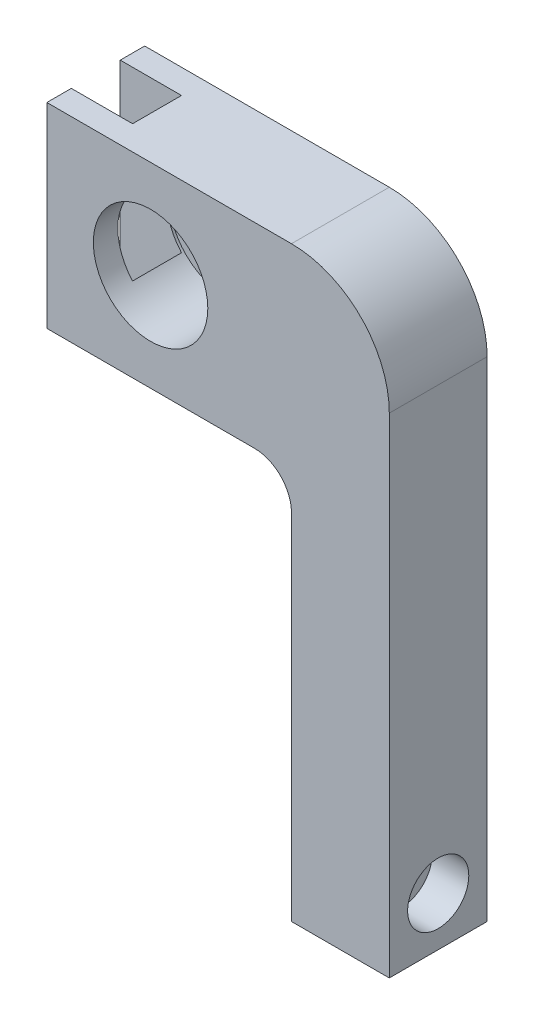
ISO-10303-21;
HEADER;
FILE_DESCRIPTION(('STEP AP214'),'2;1');
FILE_NAME('part.step','',(''),(''),'','','');
FILE_SCHEMA(('AUTOMOTIVE_DESIGN { 1 0 10303 214 1 1 1 1 }'));
ENDSEC;
DATA;
#1=APPLICATION_CONTEXT('core data for automotive mechanical design processes');
#2=APPLICATION_PROTOCOL_DEFINITION('international standard','automotive_design',2000,#1);
#3=PRODUCT_CONTEXT('',#1,'mechanical');
#4=PRODUCT('Part','Part','',(#3));
#5=PRODUCT_RELATED_PRODUCT_CATEGORY('part','',(#4));
#6=PRODUCT_DEFINITION_FORMATION('','',#4);
#7=PRODUCT_DEFINITION_CONTEXT('part definition',#1,'design');
#8=PRODUCT_DEFINITION('design','',#6,#7);
#9=PRODUCT_DEFINITION_SHAPE('','',#8);
#10=(LENGTH_UNIT() NAMED_UNIT(*) SI_UNIT(.MILLI.,.METRE.));
#11=(NAMED_UNIT(*) PLANE_ANGLE_UNIT() SI_UNIT($,.RADIAN.));
#12=(NAMED_UNIT(*) SI_UNIT($,.STERADIAN.) SOLID_ANGLE_UNIT());
#13=UNCERTAINTY_MEASURE_WITH_UNIT(LENGTH_MEASURE(1.E-05),#10,'distance_accuracy_value','');
#14=(GEOMETRIC_REPRESENTATION_CONTEXT(3) GLOBAL_UNCERTAINTY_ASSIGNED_CONTEXT((#13)) GLOBAL_UNIT_ASSIGNED_CONTEXT((#10,
#11,#12)) REPRESENTATION_CONTEXT('',''));
#15=CARTESIAN_POINT('',(0.,0.,0.));
#16=DIRECTION('',(0.,0.,1.));
#17=DIRECTION('',(1.,0.,0.));
#18=AXIS2_PLACEMENT_3D('',#15,#16,#17);
#19=CARTESIAN_POINT('',(-72.9996000000001,0.,-6.35));
#20=DIRECTION('',(1.,0.,0.));
#21=DIRECTION('',(0.,1.,0.));
#22=AXIS2_PLACEMENT_3D('',#19,#20,#21);
#23=PLANE('',#22);
#24=DIRECTION('',(0.,1.,0.));
#25=VECTOR('',#24,1.);
#26=CARTESIAN_POINT('',(-72.9996000000001,0.,-6.35));
#27=LINE('',#26,#25);
#28=CARTESIAN_POINT('',(-72.9996,136.963439368009,-6.35000000000001));
#29=VERTEX_POINT('',#28);
#30=CARTESIAN_POINT('',(-72.9996,152.4,-6.35));
#31=VERTEX_POINT('',#30);
#32=EDGE_CURVE('E237',#29,#31,#27,.T.);
#33=ORIENTED_EDGE('',*,*,#32,.F.);
#34=DIRECTION('',(0.,0.,1.));
#35=VECTOR('',#34,1.);
#36=CARTESIAN_POINT('',(-72.9996,136.963439368009,12.7));
#37=LINE('',#36,#35);
#38=CARTESIAN_POINT('',(-72.9996,136.963439368009,6.34999999999999));
#39=VERTEX_POINT('',#38);
#40=EDGE_CURVE('E70',#29,#39,#37,.T.);
#41=ORIENTED_EDGE('',*,*,#40,.T.);
#42=DIRECTION('',(0.,1.,0.));
#43=VECTOR('',#42,1.);
#44=CARTESIAN_POINT('',(-72.9996000000001,0.,6.34999999999999));
#45=LINE('',#44,#43);
#46=CARTESIAN_POINT('',(-72.9996,152.4,6.34999999999999));
#47=VERTEX_POINT('',#46);
#48=EDGE_CURVE('E239',#39,#47,#45,.T.);
#49=ORIENTED_EDGE('',*,*,#48,.T.);
#50=DIRECTION('',(0.,0.,1.));
#51=VECTOR('',#50,1.);
#52=CARTESIAN_POINT('',(-72.9996,152.4,12.7));
#53=LINE('',#52,#51);
#54=EDGE_CURVE('E243',#31,#47,#53,.T.);
#55=ORIENTED_EDGE('',*,*,#54,.F.);
#56=EDGE_LOOP('',(#33,#41,#49,#55));
#57=FACE_BOUND('',#56,.T.);
#58=ADVANCED_FACE('F54',(#57),#23,.F.);
#59=CARTESIAN_POINT('',(-88.9,152.4,12.7));
#60=DIRECTION('',(1.,0.,0.));
#61=DIRECTION('',(0.,0.,-1.));
#62=AXIS2_PLACEMENT_3D('',#59,#60,#61);
#63=PLANE('',#62);
#64=CARTESIAN_POINT('',(-88.9,149.225,-9.525));
#65=DIRECTION('',(-1.,0.,0.));
#66=DIRECTION('',(0.,0.,1.));
#67=AXIS2_PLACEMENT_3D('',#64,#65,#66);
#68=CIRCLE('',#67,1.72719999999998);
#69=CARTESIAN_POINT('',(-88.9,149.225,-7.79780000000001));
#70=VERTEX_POINT('',#69);
#71=EDGE_CURVE('E176',#70,#70,#68,.T.);
#72=ORIENTED_EDGE('',*,*,#71,.F.);
#73=EDGE_LOOP('',(#72));
#74=FACE_BOUND('',#73,.T.);
#75=CARTESIAN_POINT('',(-88.9,104.775,-9.525));
#76=DIRECTION('',(-1.,0.,0.));
#77=DIRECTION('',(0.,0.,1.));
#78=AXIS2_PLACEMENT_3D('',#75,#76,#77);
#79=CIRCLE('',#78,1.72719999999998);
#80=CARTESIAN_POINT('',(-88.9,104.775,-7.79780000000001));
#81=VERTEX_POINT('',#80);
#82=EDGE_CURVE('E193',#81,#81,#79,.T.);
#83=ORIENTED_EDGE('',*,*,#82,.F.);
#84=EDGE_LOOP('',(#83));
#85=FACE_BOUND('',#84,.T.);
#86=DIRECTION('',(0.,0.,-1.));
#87=VECTOR('',#86,1.);
#88=CARTESIAN_POINT('',(-88.9,101.6,12.7));
#89=LINE('',#88,#87);
#90=CARTESIAN_POINT('',(-88.9,101.6,-6.35));
#91=VERTEX_POINT('',#90);
#92=CARTESIAN_POINT('',(-88.9,101.6,-12.7));
#93=VERTEX_POINT('',#92);
#94=EDGE_CURVE('E294',#91,#93,#89,.T.);
#95=ORIENTED_EDGE('',*,*,#94,.F.);
#96=DIRECTION('',(0.,1.,0.));
#97=VECTOR('',#96,1.);
#98=CARTESIAN_POINT('',(-88.9000000000001,0.,-6.35));
#99=LINE('',#98,#97);
#100=CARTESIAN_POINT('',(-88.9,152.4,-6.35));
#101=VERTEX_POINT('',#100);
#102=EDGE_CURVE('E230',#91,#101,#99,.T.);
#103=ORIENTED_EDGE('',*,*,#102,.T.);
#104=DIRECTION('',(0.,0.,-1.));
#105=VECTOR('',#104,1.);
#106=CARTESIAN_POINT('',(-88.9,152.4,12.7));
#107=LINE('',#106,#105);
#108=CARTESIAN_POINT('',(-88.9,152.4,-12.7));
#109=VERTEX_POINT('',#108);
#110=EDGE_CURVE('E298',#101,#109,#107,.T.);
#111=ORIENTED_EDGE('',*,*,#110,.T.);
#112=DIRECTION('',(0.,-1.,0.));
#113=VECTOR('',#112,1.);
#114=CARTESIAN_POINT('',(-88.9,152.4,-12.7));
#115=LINE('',#114,#113);
#116=EDGE_CURVE('E278',#109,#93,#115,.T.);
#117=ORIENTED_EDGE('',*,*,#116,.T.);
#118=EDGE_LOOP('',(#95,#103,#111,#117));
#119=FACE_BOUND('',#118,.T.);
#120=ADVANCED_FACE('F324',(#74,#85,#119),#63,.F.);
#121=CARTESIAN_POINT('',(-25.4,0.,12.7));
#122=DIRECTION('',(0.,1.,0.));
#123=DIRECTION('',(0.,0.,1.));
#124=AXIS2_PLACEMENT_3D('',#121,#122,#123);
#125=PLANE('',#124);
#126=DIRECTION('',(1.,0.,0.));
#127=VECTOR('',#126,1.);
#128=CARTESIAN_POINT('',(-25.4,0.,-12.7));
#129=LINE('',#128,#127);
#130=CARTESIAN_POINT('',(-25.4,0.,-12.7));
#131=VERTEX_POINT('',#130);
#132=CARTESIAN_POINT('',(0.,0.,-12.7));
#133=VERTEX_POINT('',#132);
#134=EDGE_CURVE('E249',#131,#133,#129,.T.);
#135=ORIENTED_EDGE('',*,*,#134,.T.);
#136=DIRECTION('',(0.,0.,-1.));
#137=VECTOR('',#136,1.);
#138=CARTESIAN_POINT('',(0.,0.,12.7));
#139=LINE('',#138,#137);
#140=CARTESIAN_POINT('',(0.,0.,12.7));
#141=VERTEX_POINT('',#140);
#142=EDGE_CURVE('E308',#141,#133,#139,.T.);
#143=ORIENTED_EDGE('',*,*,#142,.F.);
#144=DIRECTION('',(1.,0.,0.));
#145=VECTOR('',#144,1.);
#146=CARTESIAN_POINT('',(-25.4,0.,12.7));
#147=LINE('',#146,#145);
#148=CARTESIAN_POINT('',(-25.4,0.,12.7));
#149=VERTEX_POINT('',#148);
#150=EDGE_CURVE('E250',#149,#141,#147,.T.);
#151=ORIENTED_EDGE('',*,*,#150,.F.);
#152=DIRECTION('',(0.,0.,-1.));
#153=VECTOR('',#152,1.);
#154=CARTESIAN_POINT('',(-25.4,0.,12.7));
#155=LINE('',#154,#153);
#156=EDGE_CURVE('E268',#149,#131,#155,.T.);
#157=ORIENTED_EDGE('',*,*,#156,.T.);
#158=EDGE_LOOP('',(#135,#143,#151,#157));
#159=FACE_BOUND('',#158,.T.);
#160=ADVANCED_FACE('F56',(#159),#125,.F.);
#161=CARTESIAN_POINT('',(0.,0.,12.7));
#162=DIRECTION('',(-1.,0.,0.));
#163=DIRECTION('',(0.,0.,1.));
#164=AXIS2_PLACEMENT_3D('',#161,#162,#163);
#165=PLANE('',#164);
#166=CARTESIAN_POINT('',(0.,12.7,0.));
#167=DIRECTION('',(1.,0.,0.));
#168=DIRECTION('',(0.,0.,-1.));
#169=AXIS2_PLACEMENT_3D('',#166,#167,#168);
#170=CIRCLE('',#169,7.9375);
#171=CARTESIAN_POINT('',(0.,12.7,-7.9375));
#172=VERTEX_POINT('',#171);
#173=EDGE_CURVE('E199',#172,#172,#170,.T.);
#174=ORIENTED_EDGE('',*,*,#173,.F.);
#175=EDGE_LOOP('',(#174));
#176=FACE_BOUND('',#175,.T.);
#177=DIRECTION('',(0.,1.,0.));
#178=VECTOR('',#177,1.);
#179=CARTESIAN_POINT('',(0.,0.,-12.7));
#180=LINE('',#179,#178);
#181=CARTESIAN_POINT('',(0.,127.,-12.7));
#182=VERTEX_POINT('',#181);
#183=EDGE_CURVE('E271',#133,#182,#180,.T.);
#184=ORIENTED_EDGE('',*,*,#183,.T.);
#185=DIRECTION('',(0.,0.,-1.));
#186=VECTOR('',#185,1.);
#187=CARTESIAN_POINT('',(0.,127.,12.7));
#188=LINE('',#187,#186);
#189=CARTESIAN_POINT('',(0.,127.,12.7));
#190=VERTEX_POINT('',#189);
#191=EDGE_CURVE('E305',#190,#182,#188,.T.);
#192=ORIENTED_EDGE('',*,*,#191,.F.);
#193=DIRECTION('',(0.,1.,0.));
#194=VECTOR('',#193,1.);
#195=CARTESIAN_POINT('',(0.,0.,12.7));
#196=LINE('',#195,#194);
#197=EDGE_CURVE('E253',#141,#190,#196,.T.);
#198=ORIENTED_EDGE('',*,*,#197,.F.);
#199=ORIENTED_EDGE('',*,*,#142,.T.);
#200=EDGE_LOOP('',(#184,#192,#198,#199));
#201=FACE_BOUND('',#200,.T.);
#202=ADVANCED_FACE('F465',(#176,#201),#165,.F.);
#203=CARTESIAN_POINT('',(-25.4,127.,12.7));
#204=DIRECTION('',(0.,0.,-1.));
#205=DIRECTION('',(-1.,0.,0.));
#206=AXIS2_PLACEMENT_3D('',#203,#204,#205);
#207=CYLINDRICAL_SURFACE('',#206,25.4);
#208=CARTESIAN_POINT('',(-25.4,127.,-12.7));
#209=DIRECTION('',(0.,0.,1.));
#210=DIRECTION('',(-1.,0.,0.));
#211=AXIS2_PLACEMENT_3D('',#208,#209,#210);
#212=CIRCLE('',#211,25.4);
#213=CARTESIAN_POINT('',(-25.4,152.4,-12.7));
#214=VERTEX_POINT('',#213);
#215=EDGE_CURVE('E273',#182,#214,#212,.T.);
#216=ORIENTED_EDGE('',*,*,#215,.T.);
#217=DIRECTION('',(0.,0.,-1.));
#218=VECTOR('',#217,1.);
#219=CARTESIAN_POINT('',(-25.4,152.4,12.7));
#220=LINE('',#219,#218);
#221=CARTESIAN_POINT('',(-25.4,152.4,12.7));
#222=VERTEX_POINT('',#221);
#223=EDGE_CURVE('E302',#222,#214,#220,.T.);
#224=ORIENTED_EDGE('',*,*,#223,.F.);
#225=CARTESIAN_POINT('',(-25.4,127.,12.7));
#226=DIRECTION('',(0.,0.,1.));
#227=DIRECTION('',(-1.,0.,0.));
#228=AXIS2_PLACEMENT_3D('',#225,#226,#227);
#229=CIRCLE('',#228,25.4);
#230=EDGE_CURVE('E256',#190,#222,#229,.T.);
#231=ORIENTED_EDGE('',*,*,#230,.F.);
#232=ORIENTED_EDGE('',*,*,#191,.T.);
#233=EDGE_LOOP('',(#216,#224,#231,#232));
#234=FACE_BOUND('',#233,.T.);
#235=ADVANCED_FACE('F460',(#234),#207,.T.);
#236=CARTESIAN_POINT('',(-25.4,152.4,12.7));
#237=DIRECTION('',(0.,-1.,0.));
#238=DIRECTION('',(1.,0.,0.));
#239=AXIS2_PLACEMENT_3D('',#236,#237,#238);
#240=PLANE('',#239);
#241=ORIENTED_EDGE('',*,*,#110,.F.);
#242=DIRECTION('',(1.,0.,0.));
#243=VECTOR('',#242,1.);
#244=CARTESIAN_POINT('',(-25.4,152.4,-6.35000000000001));
#245=LINE('',#244,#243);
#246=EDGE_CURVE('E246',#101,#31,#245,.T.);
#247=ORIENTED_EDGE('',*,*,#246,.T.);
#248=ORIENTED_EDGE('',*,*,#54,.T.);
#249=DIRECTION('',(-1.,0.,0.));
#250=VECTOR('',#249,1.);
#251=CARTESIAN_POINT('',(-25.4,152.4,6.34999999999999));
#252=LINE('',#251,#250);
#253=CARTESIAN_POINT('',(-88.9,152.4,6.35));
#254=VERTEX_POINT('',#253);
#255=EDGE_CURVE('E233',#47,#254,#252,.T.);
#256=ORIENTED_EDGE('',*,*,#255,.T.);
#257=CARTESIAN_POINT('',(-88.9,152.4,12.7));
#258=VERTEX_POINT('',#257);
#259=EDGE_CURVE('E299',#258,#254,#107,.T.);
#260=ORIENTED_EDGE('',*,*,#259,.F.);
#261=DIRECTION('',(-1.,0.,0.));
#262=VECTOR('',#261,1.);
#263=CARTESIAN_POINT('',(-25.4,152.4,12.7));
#264=LINE('',#263,#262);
#265=EDGE_CURVE('E258',#222,#258,#264,.T.);
#266=ORIENTED_EDGE('',*,*,#265,.F.);
#267=ORIENTED_EDGE('',*,*,#223,.T.);
#268=DIRECTION('',(-1.,0.,0.));
#269=VECTOR('',#268,1.);
#270=CARTESIAN_POINT('',(-25.4,152.4,-12.7));
#271=LINE('',#270,#269);
#272=EDGE_CURVE('E275',#214,#109,#271,.T.);
#273=ORIENTED_EDGE('',*,*,#272,.T.);
#274=EDGE_LOOP('',(#241,#247,#248,#256,#260,#266,#267,#273));
#275=FACE_BOUND('',#274,.T.);
#276=ADVANCED_FACE('F354',(#275),#240,.F.);
#277=CARTESIAN_POINT('',(-88.8999999999999,149.225,9.525));
#278=DIRECTION('',(-1.,0.,0.));
#279=DIRECTION('',(0.,0.,1.));
#280=AXIS2_PLACEMENT_3D('',#277,#278,#279);
#281=CIRCLE('',#280,1.72719999999998);
#282=CARTESIAN_POINT('',(-88.8999999999999,149.225,11.2522));
#283=VERTEX_POINT('',#282);
#284=EDGE_CURVE('E177',#283,#283,#281,.T.);
#285=ORIENTED_EDGE('',*,*,#284,.F.);
#286=EDGE_LOOP('',(#285));
#287=FACE_BOUND('',#286,.T.);
#288=CARTESIAN_POINT('',(-88.8999999999999,104.775,9.525));
#289=DIRECTION('',(-1.,0.,0.));
#290=DIRECTION('',(0.,0.,1.));
#291=AXIS2_PLACEMENT_3D('',#288,#289,#290);
#292=CIRCLE('',#291,1.72719999999998);
#293=CARTESIAN_POINT('',(-88.8999999999999,104.775,11.2522));
#294=VERTEX_POINT('',#293);
#295=EDGE_CURVE('E187',#294,#294,#292,.T.);
#296=ORIENTED_EDGE('',*,*,#295,.F.);
#297=EDGE_LOOP('',(#296));
#298=FACE_BOUND('',#297,.T.);
#299=ORIENTED_EDGE('',*,*,#259,.T.);
#300=DIRECTION('',(0.,1.,0.));
#301=VECTOR('',#300,1.);
#302=CARTESIAN_POINT('',(-88.9000000000001,0.,6.35));
#303=LINE('',#302,#301);
#304=CARTESIAN_POINT('',(-88.9,101.6,6.35));
#305=VERTEX_POINT('',#304);
#306=EDGE_CURVE('E229',#305,#254,#303,.T.);
#307=ORIENTED_EDGE('',*,*,#306,.F.);
#308=CARTESIAN_POINT('',(-88.9,101.6,12.7));
#309=VERTEX_POINT('',#308);
#310=EDGE_CURVE('E295',#309,#305,#89,.T.);
#311=ORIENTED_EDGE('',*,*,#310,.F.);
#312=DIRECTION('',(0.,-1.,0.));
#313=VECTOR('',#312,1.);
#314=CARTESIAN_POINT('',(-88.9,152.4,12.7));
#315=LINE('',#314,#313);
#316=EDGE_CURVE('E260',#258,#309,#315,.T.);
#317=ORIENTED_EDGE('',*,*,#316,.F.);
#318=EDGE_LOOP('',(#299,#307,#311,#317));
#319=FACE_BOUND('',#318,.T.);
#320=ADVANCED_FACE('F348',(#287,#298,#319),#63,.F.);
#321=CARTESIAN_POINT('',(-88.9,101.6,12.7));
#322=DIRECTION('',(0.,1.,0.));
#323=DIRECTION('',(-1.,0.,0.));
#324=AXIS2_PLACEMENT_3D('',#321,#322,#323);
#325=PLANE('',#324);
#326=DIRECTION('',(0.,0.,-1.));
#327=VECTOR('',#326,1.);
#328=CARTESIAN_POINT('',(-72.9996,101.6,12.7));
#329=LINE('',#328,#327);
#330=CARTESIAN_POINT('',(-72.9996,101.6,6.34999999999999));
#331=VERTEX_POINT('',#330);
#332=CARTESIAN_POINT('',(-72.9996,101.6,-6.35));
#333=VERTEX_POINT('',#332);
#334=EDGE_CURVE('E314',#331,#333,#329,.T.);
#335=ORIENTED_EDGE('',*,*,#334,.T.);
#336=DIRECTION('',(-1.,0.,0.));
#337=VECTOR('',#336,1.);
#338=CARTESIAN_POINT('',(-88.9,101.6,-6.35));
#339=LINE('',#338,#337);
#340=EDGE_CURVE('E63',#333,#91,#339,.T.);
#341=ORIENTED_EDGE('',*,*,#340,.T.);
#342=ORIENTED_EDGE('',*,*,#94,.T.);
#343=DIRECTION('',(1.,0.,0.));
#344=VECTOR('',#343,1.);
#345=CARTESIAN_POINT('',(-88.9,101.6,-12.7));
#346=LINE('',#345,#344);
#347=CARTESIAN_POINT('',(-35.052,101.6,-12.7));
#348=VERTEX_POINT('',#347);
#349=EDGE_CURVE('E281',#93,#348,#346,.T.);
#350=ORIENTED_EDGE('',*,*,#349,.T.);
#351=DIRECTION('',(0.,0.,-1.));
#352=VECTOR('',#351,1.);
#353=CARTESIAN_POINT('',(-35.052,101.6,12.7));
#354=LINE('',#353,#352);
#355=CARTESIAN_POINT('',(-35.052,101.6,12.7));
#356=VERTEX_POINT('',#355);
#357=EDGE_CURVE('E291',#356,#348,#354,.T.);
#358=ORIENTED_EDGE('',*,*,#357,.F.);
#359=DIRECTION('',(1.,0.,0.));
#360=VECTOR('',#359,1.);
#361=CARTESIAN_POINT('',(-88.9,101.6,12.7));
#362=LINE('',#361,#360);
#363=EDGE_CURVE('E262',#309,#356,#362,.T.);
#364=ORIENTED_EDGE('',*,*,#363,.F.);
#365=ORIENTED_EDGE('',*,*,#310,.T.);
#366=DIRECTION('',(1.,0.,0.));
#367=VECTOR('',#366,1.);
#368=CARTESIAN_POINT('',(-88.9,101.6,6.35));
#369=LINE('',#368,#367);
#370=EDGE_CURVE('E311',#305,#331,#369,.T.);
#371=ORIENTED_EDGE('',*,*,#370,.T.);
#372=EDGE_LOOP('',(#335,#341,#342,#350,#358,#364,#365,#371));
#373=FACE_BOUND('',#372,.T.);
#374=ADVANCED_FACE('F320',(#373),#325,.F.);
#375=CARTESIAN_POINT('',(-35.052,91.948,12.7));
#376=DIRECTION('',(0.,0.,-1.));
#377=DIRECTION('',(-1.,0.,0.));
#378=AXIS2_PLACEMENT_3D('',#375,#376,#377);
#379=CYLINDRICAL_SURFACE('',#378,9.65199999999998);
#380=CARTESIAN_POINT('',(-35.052,91.948,-12.7));
#381=DIRECTION('',(0.,0.,-1.));
#382=DIRECTION('',(-1.,0.,0.));
#383=AXIS2_PLACEMENT_3D('',#380,#381,#382);
#384=CIRCLE('',#383,9.65199999999998);
#385=CARTESIAN_POINT('',(-25.4,91.948,-12.7));
#386=VERTEX_POINT('',#385);
#387=EDGE_CURVE('E283',#348,#386,#384,.T.);
#388=ORIENTED_EDGE('',*,*,#387,.T.);
#389=DIRECTION('',(0.,0.,-1.));
#390=VECTOR('',#389,1.);
#391=CARTESIAN_POINT('',(-25.4,91.948,12.7));
#392=LINE('',#391,#390);
#393=CARTESIAN_POINT('',(-25.4,91.948,12.7));
#394=VERTEX_POINT('',#393);
#395=EDGE_CURVE('E288',#394,#386,#392,.T.);
#396=ORIENTED_EDGE('',*,*,#395,.F.);
#397=CARTESIAN_POINT('',(-35.052,91.948,12.7));
#398=DIRECTION('',(0.,0.,-1.));
#399=DIRECTION('',(-1.,0.,0.));
#400=AXIS2_PLACEMENT_3D('',#397,#398,#399);
#401=CIRCLE('',#400,9.65199999999998);
#402=EDGE_CURVE('E264',#356,#394,#401,.T.);
#403=ORIENTED_EDGE('',*,*,#402,.F.);
#404=ORIENTED_EDGE('',*,*,#357,.T.);
#405=EDGE_LOOP('',(#388,#396,#403,#404));
#406=FACE_BOUND('',#405,.T.);
#407=ADVANCED_FACE('F338',(#406),#379,.F.);
#408=CARTESIAN_POINT('',(-25.4,91.948,12.7));
#409=DIRECTION('',(1.,0.,0.));
#410=DIRECTION('',(0.,1.,0.));
#411=AXIS2_PLACEMENT_3D('',#408,#409,#410);
#412=PLANE('',#411);
#413=CARTESIAN_POINT('',(-25.4,12.7,0.));
#414=DIRECTION('',(1.,0.,0.));
#415=DIRECTION('',(0.,1.,0.));
#416=AXIS2_PLACEMENT_3D('',#413,#414,#415);
#417=CIRCLE('',#416,5.04189999999999);
#418=CARTESIAN_POINT('',(-25.4,17.7419,0.));
#419=VERTEX_POINT('',#418);
#420=EDGE_CURVE('E58',#419,#419,#417,.T.);
#421=ORIENTED_EDGE('',*,*,#420,.T.);
#422=EDGE_LOOP('',(#421));
#423=FACE_BOUND('',#422,.T.);
#424=DIRECTION('',(0.,-1.,0.));
#425=VECTOR('',#424,1.);
#426=CARTESIAN_POINT('',(-25.4,91.948,-12.7));
#427=LINE('',#426,#425);
#428=EDGE_CURVE('E254',#386,#131,#427,.T.);
#429=ORIENTED_EDGE('',*,*,#428,.T.);
#430=ORIENTED_EDGE('',*,*,#156,.F.);
#431=DIRECTION('',(0.,-1.,0.));
#432=VECTOR('',#431,1.);
#433=CARTESIAN_POINT('',(-25.4,91.948,12.7));
#434=LINE('',#433,#432);
#435=EDGE_CURVE('E266',#394,#149,#434,.T.);
#436=ORIENTED_EDGE('',*,*,#435,.F.);
#437=ORIENTED_EDGE('',*,*,#395,.T.);
#438=EDGE_LOOP('',(#429,#430,#436,#437));
#439=FACE_BOUND('',#438,.T.);
#440=ADVANCED_FACE('F482',(#423,#439),#412,.F.);
#441=CARTESIAN_POINT('',(-25.4,127.,12.7));
#442=DIRECTION('',(0.,0.,-1.));
#443=DIRECTION('',(-1.,0.,0.));
#444=AXIS2_PLACEMENT_3D('',#441,#442,#443);
#445=PLANE('',#444);
#446=CARTESIAN_POINT('',(-61.976,127.,12.7));
#447=DIRECTION('',(0.,0.,1.));
#448=DIRECTION('',(1.,0.,0.));
#449=AXIS2_PLACEMENT_3D('',#446,#447,#448);
#450=CIRCLE('',#449,14.859);
#451=CARTESIAN_POINT('',(-47.117,127.,12.7));
#452=VERTEX_POINT('',#451);
#453=EDGE_CURVE('E211',#452,#452,#450,.T.);
#454=ORIENTED_EDGE('',*,*,#453,.F.);
#455=EDGE_LOOP('',(#454));
#456=FACE_BOUND('',#455,.T.);
#457=ORIENTED_EDGE('',*,*,#150,.T.);
#458=ORIENTED_EDGE('',*,*,#197,.T.);
#459=ORIENTED_EDGE('',*,*,#230,.T.);
#460=ORIENTED_EDGE('',*,*,#265,.T.);
#461=ORIENTED_EDGE('',*,*,#316,.T.);
#462=ORIENTED_EDGE('',*,*,#363,.T.);
#463=ORIENTED_EDGE('',*,*,#402,.T.);
#464=ORIENTED_EDGE('',*,*,#435,.T.);
#465=EDGE_LOOP('',(#457,#458,#459,#460,#461,#462,#463,#464));
#466=FACE_BOUND('',#465,.T.);
#467=ADVANCED_FACE('F342',(#456,#466),#445,.F.);
#468=CARTESIAN_POINT('',(-25.4,127.,-12.7));
#469=DIRECTION('',(0.,0.,-1.));
#470=DIRECTION('',(-1.,0.,0.));
#471=AXIS2_PLACEMENT_3D('',#468,#469,#470);
#472=PLANE('',#471);
#473=CARTESIAN_POINT('',(-61.976,127.,-12.7));
#474=DIRECTION('',(0.,0.,1.));
#475=DIRECTION('',(1.,0.,0.));
#476=AXIS2_PLACEMENT_3D('',#473,#474,#475);
#477=CIRCLE('',#476,6.34999999999999);
#478=CARTESIAN_POINT('',(-55.626,127.,-12.7));
#479=VERTEX_POINT('',#478);
#480=EDGE_CURVE('E220',#479,#479,#477,.T.);
#481=ORIENTED_EDGE('',*,*,#480,.T.);
#482=EDGE_LOOP('',(#481));
#483=FACE_BOUND('',#482,.T.);
#484=ORIENTED_EDGE('',*,*,#134,.F.);
#485=ORIENTED_EDGE('',*,*,#428,.F.);
#486=ORIENTED_EDGE('',*,*,#387,.F.);
#487=ORIENTED_EDGE('',*,*,#349,.F.);
#488=ORIENTED_EDGE('',*,*,#116,.F.);
#489=ORIENTED_EDGE('',*,*,#272,.F.);
#490=ORIENTED_EDGE('',*,*,#215,.F.);
#491=ORIENTED_EDGE('',*,*,#183,.F.);
#492=EDGE_LOOP('',(#484,#485,#486,#487,#488,#489,#490,#491));
#493=FACE_BOUND('',#492,.T.);
#494=ADVANCED_FACE('F332',(#483,#493),#472,.T.);
#495=CARTESIAN_POINT('',(-72.9996000000001,0.,-6.35));
#496=DIRECTION('',(0.,0.,-1.));
#497=DIRECTION('',(-1.,0.,0.));
#498=AXIS2_PLACEMENT_3D('',#495,#496,#497);
#499=PLANE('',#498);
#500=CARTESIAN_POINT('',(-72.9996,117.036560631991,-6.35000000000001));
#501=VERTEX_POINT('',#500);
#502=EDGE_CURVE('E234',#333,#501,#27,.T.);
#503=ORIENTED_EDGE('',*,*,#502,.T.);
#504=CARTESIAN_POINT('',(-61.976,127.,-6.35000000000001));
#505=DIRECTION('',(0.,0.,-1.));
#506=DIRECTION('',(-1.,0.,0.));
#507=AXIS2_PLACEMENT_3D('',#504,#505,#506);
#508=CIRCLE('',#507,14.859);
#509=EDGE_CURVE('E13',#501,#29,#508,.T.);
#510=ORIENTED_EDGE('',*,*,#509,.T.);
#511=ORIENTED_EDGE('',*,*,#32,.T.);
#512=ORIENTED_EDGE('',*,*,#246,.F.);
#513=ORIENTED_EDGE('',*,*,#102,.F.);
#514=ORIENTED_EDGE('',*,*,#340,.F.);
#515=EDGE_LOOP('',(#503,#510,#511,#512,#513,#514));
#516=FACE_BOUND('',#515,.T.);
#517=ADVANCED_FACE('F361',(#516),#499,.F.);
#518=CARTESIAN_POINT('',(-72.9996,117.036560631991,6.34999999999999));
#519=VERTEX_POINT('',#518);
#520=EDGE_CURVE('E77',#331,#519,#45,.T.);
#521=ORIENTED_EDGE('',*,*,#520,.T.);
#522=DIRECTION('',(0.,0.,1.));
#523=VECTOR('',#522,1.);
#524=CARTESIAN_POINT('',(-72.9996,117.036560631991,12.7));
#525=LINE('',#524,#523);
#526=EDGE_CURVE('E223',#519,#501,#525,.F.);
#527=ORIENTED_EDGE('',*,*,#526,.T.);
#528=ORIENTED_EDGE('',*,*,#502,.F.);
#529=ORIENTED_EDGE('',*,*,#334,.F.);
#530=EDGE_LOOP('',(#521,#527,#528,#529));
#531=FACE_BOUND('',#530,.T.);
#532=ADVANCED_FACE('F360',(#531),#23,.F.);
#533=CARTESIAN_POINT('',(-72.9996000000001,0.,6.34999999999999));
#534=DIRECTION('',(0.,0.,1.));
#535=DIRECTION('',(1.,0.,0.));
#536=AXIS2_PLACEMENT_3D('',#533,#534,#535);
#537=PLANE('',#536);
#538=ORIENTED_EDGE('',*,*,#48,.F.);
#539=CARTESIAN_POINT('',(-61.976,127.,6.34999999999999));
#540=DIRECTION('',(0.,0.,1.));
#541=DIRECTION('',(1.,0.,0.));
#542=AXIS2_PLACEMENT_3D('',#539,#540,#541);
#543=CIRCLE('',#542,14.859);
#544=EDGE_CURVE('E227',#39,#519,#543,.T.);
#545=ORIENTED_EDGE('',*,*,#544,.T.);
#546=ORIENTED_EDGE('',*,*,#520,.F.);
#547=ORIENTED_EDGE('',*,*,#370,.F.);
#548=ORIENTED_EDGE('',*,*,#306,.T.);
#549=ORIENTED_EDGE('',*,*,#255,.F.);
#550=EDGE_LOOP('',(#538,#545,#546,#547,#548,#549));
#551=FACE_BOUND('',#550,.T.);
#552=ADVANCED_FACE('F352',(#551),#537,.F.);
#553=CARTESIAN_POINT('',(-61.976,127.,12.7));
#554=DIRECTION('',(0.,0.,1.));
#555=DIRECTION('',(1.,0.,0.));
#556=AXIS2_PLACEMENT_3D('',#553,#554,#555);
#557=CYLINDRICAL_SURFACE('',#556,14.859);
#558=CARTESIAN_POINT('',(-61.976,127.,-7.0104));
#559=DIRECTION('',(0.,0.,1.));
#560=DIRECTION('',(1.,0.,0.));
#561=AXIS2_PLACEMENT_3D('',#558,#559,#560);
#562=CIRCLE('',#561,14.859);
#563=CARTESIAN_POINT('',(-47.117,127.,-7.0104));
#564=VERTEX_POINT('',#563);
#565=EDGE_CURVE('E214',#564,#564,#562,.T.);
#566=ORIENTED_EDGE('',*,*,#565,.F.);
#567=EDGE_LOOP('',(#566));
#568=FACE_BOUND('',#567,.T.);
#569=ORIENTED_EDGE('',*,*,#453,.T.);
#570=EDGE_LOOP('',(#569));
#571=FACE_BOUND('',#570,.T.);
#572=ORIENTED_EDGE('',*,*,#40,.F.);
#573=ORIENTED_EDGE('',*,*,#509,.F.);
#574=ORIENTED_EDGE('',*,*,#526,.F.);
#575=ORIENTED_EDGE('',*,*,#544,.F.);
#576=EDGE_LOOP('',(#572,#573,#574,#575));
#577=FACE_BOUND('',#576,.T.);
#578=ADVANCED_FACE('F362',(#568,#571,#577),#557,.F.);
#579=CARTESIAN_POINT('',(-61.976,127.,12.7));
#580=DIRECTION('',(0.,0.,1.));
#581=DIRECTION('',(1.,0.,0.));
#582=AXIS2_PLACEMENT_3D('',#579,#580,#581);
#583=CYLINDRICAL_SURFACE('',#582,6.34999999999999);
#584=ORIENTED_EDGE('',*,*,#480,.F.);
#585=EDGE_LOOP('',(#584));
#586=FACE_BOUND('',#585,.T.);
#587=CARTESIAN_POINT('',(-61.976,127.,-7.0104));
#588=DIRECTION('',(0.,0.,1.));
#589=DIRECTION('',(1.,0.,0.));
#590=AXIS2_PLACEMENT_3D('',#587,#588,#589);
#591=CIRCLE('',#590,6.34999999999999);
#592=CARTESIAN_POINT('',(-55.626,127.,-7.0104));
#593=VERTEX_POINT('',#592);
#594=EDGE_CURVE('E217',#593,#593,#591,.T.);
#595=ORIENTED_EDGE('',*,*,#594,.T.);
#596=EDGE_LOOP('',(#595));
#597=FACE_BOUND('',#596,.T.);
#598=ADVANCED_FACE('F364',(#586,#597),#583,.F.);
#599=CARTESIAN_POINT('',(-55.626,127.,-7.0104));
#600=DIRECTION('',(0.,0.,-1.));
#601=DIRECTION('',(-1.,0.,0.));
#602=AXIS2_PLACEMENT_3D('',#599,#600,#601);
#603=PLANE('',#602);
#604=ORIENTED_EDGE('',*,*,#594,.F.);
#605=EDGE_LOOP('',(#604));
#606=FACE_BOUND('',#605,.T.);
#607=ORIENTED_EDGE('',*,*,#565,.T.);
#608=EDGE_LOOP('',(#607));
#609=FACE_BOUND('',#608,.T.);
#610=ADVANCED_FACE('F371',(#606,#609),#603,.F.);
#611=CARTESIAN_POINT('',(0.,12.7,0.));
#612=DIRECTION('',(1.,0.,0.));
#613=DIRECTION('',(0.,0.,-1.));
#614=AXIS2_PLACEMENT_3D('',#611,#612,#613);
#615=CYLINDRICAL_SURFACE('',#614,5.04189999999999);
#616=CARTESIAN_POINT('',(-9.70051138681795,12.7,0.));
#617=DIRECTION('',(1.,0.,0.));
#618=DIRECTION('',(0.,0.,-1.));
#619=AXIS2_PLACEMENT_3D('',#616,#617,#618);
#620=CIRCLE('',#619,5.0419);
#621=CARTESIAN_POINT('',(-9.70051138681795,12.7,-5.0419));
#622=VERTEX_POINT('',#621);
#623=EDGE_CURVE('E208',#622,#622,#620,.T.);
#624=ORIENTED_EDGE('',*,*,#623,.T.);
#625=EDGE_LOOP('',(#624));
#626=FACE_BOUND('',#625,.T.);
#627=ORIENTED_EDGE('',*,*,#420,.F.);
#628=EDGE_LOOP('',(#627));
#629=FACE_BOUND('',#628,.T.);
#630=ADVANCED_FACE('F397',(#626,#629),#615,.F.);
#631=CARTESIAN_POINT('',(-9.52499999999999,12.7,0.));
#632=DIRECTION('',(1.,0.,0.));
#633=DIRECTION('',(0.,0.,-1.));
#634=AXIS2_PLACEMENT_3D('',#631,#632,#633);
#635=CONICAL_SURFACE('',#634,5.334,1.02974425867666);
#636=ORIENTED_EDGE('',*,*,#623,.F.);
#637=EDGE_LOOP('',(#636));
#638=FACE_BOUND('',#637,.T.);
#639=CARTESIAN_POINT('',(-9.52499999999999,12.7,0.));
#640=DIRECTION('',(1.,0.,0.));
#641=DIRECTION('',(0.,0.,-1.));
#642=AXIS2_PLACEMENT_3D('',#639,#640,#641);
#643=CIRCLE('',#642,5.334);
#644=CARTESIAN_POINT('',(-9.52499999999999,12.7,-5.334));
#645=VERTEX_POINT('',#644);
#646=EDGE_CURVE('E205',#645,#645,#643,.T.);
#647=ORIENTED_EDGE('',*,*,#646,.T.);
#648=EDGE_LOOP('',(#647));
#649=FACE_BOUND('',#648,.T.);
#650=ADVANCED_FACE('F402',(#638,#649),#635,.F.);
#651=CARTESIAN_POINT('',(-9.52499999999999,18.034,0.));
#652=DIRECTION('',(-1.,0.,0.));
#653=DIRECTION('',(0.,0.,1.));
#654=AXIS2_PLACEMENT_3D('',#651,#652,#653);
#655=PLANE('',#654);
#656=ORIENTED_EDGE('',*,*,#646,.F.);
#657=EDGE_LOOP('',(#656));
#658=FACE_BOUND('',#657,.T.);
#659=CARTESIAN_POINT('',(-9.52499999999999,12.7,0.));
#660=DIRECTION('',(1.,0.,0.));
#661=DIRECTION('',(0.,0.,-1.));
#662=AXIS2_PLACEMENT_3D('',#659,#660,#661);
#663=CIRCLE('',#662,7.9375);
#664=CARTESIAN_POINT('',(-9.52499999999999,12.7,-7.9375));
#665=VERTEX_POINT('',#664);
#666=EDGE_CURVE('E202',#665,#665,#663,.T.);
#667=ORIENTED_EDGE('',*,*,#666,.T.);
#668=EDGE_LOOP('',(#667));
#669=FACE_BOUND('',#668,.T.);
#670=ADVANCED_FACE('F410',(#658,#669),#655,.F.);
#671=CARTESIAN_POINT('',(0.,12.7,0.));
#672=DIRECTION('',(1.,0.,0.));
#673=DIRECTION('',(0.,0.,-1.));
#674=AXIS2_PLACEMENT_3D('',#671,#672,#673);
#675=CYLINDRICAL_SURFACE('',#674,7.9375);
#676=ORIENTED_EDGE('',*,*,#666,.F.);
#677=EDGE_LOOP('',(#676));
#678=FACE_BOUND('',#677,.T.);
#679=ORIENTED_EDGE('',*,*,#173,.T.);
#680=EDGE_LOOP('',(#679));
#681=FACE_BOUND('',#680,.T.);
#682=ADVANCED_FACE('F417',(#678,#681),#675,.F.);
#683=CARTESIAN_POINT('',(-80.01,104.775,-9.525));
#684=DIRECTION('',(-1.,0.,0.));
#685=DIRECTION('',(0.,0.,1.));
#686=AXIS2_PLACEMENT_3D('',#683,#684,#685);
#687=CONICAL_SURFACE('',#686,1.7272,1.02974425867665);
#688=CARTESIAN_POINT('',(-78.9721935388156,104.775,-9.525));
#689=VERTEX_POINT('',#688);
#690=VERTEX_LOOP('',#689);
#691=FACE_BOUND('',#690,.T.);
#692=CARTESIAN_POINT('',(-80.01,104.775,-9.525));
#693=DIRECTION('',(-1.,0.,0.));
#694=DIRECTION('',(0.,0.,1.));
#695=AXIS2_PLACEMENT_3D('',#692,#693,#694);
#696=CIRCLE('',#695,1.7272);
#697=CARTESIAN_POINT('',(-80.01,104.775,-7.7978));
#698=VERTEX_POINT('',#697);
#699=EDGE_CURVE('E196',#698,#698,#696,.T.);
#700=ORIENTED_EDGE('',*,*,#699,.T.);
#701=EDGE_LOOP('',(#700));
#702=FACE_BOUND('',#701,.T.);
#703=ADVANCED_FACE('F421',(#691,#702),#687,.F.);
#704=CARTESIAN_POINT('',(-88.9,104.775,-9.525));
#705=DIRECTION('',(-1.,0.,0.));
#706=DIRECTION('',(0.,0.,1.));
#707=AXIS2_PLACEMENT_3D('',#704,#705,#706);
#708=CYLINDRICAL_SURFACE('',#707,1.72719999999999);
#709=ORIENTED_EDGE('',*,*,#699,.F.);
#710=EDGE_LOOP('',(#709));
#711=FACE_BOUND('',#710,.T.);
#712=ORIENTED_EDGE('',*,*,#82,.T.);
#713=EDGE_LOOP('',(#712));
#714=FACE_BOUND('',#713,.T.);
#715=ADVANCED_FACE('F425',(#711,#714),#708,.F.);
#716=CARTESIAN_POINT('',(-80.0099999999999,104.775,9.525));
#717=DIRECTION('',(-1.,0.,0.));
#718=DIRECTION('',(0.,0.,1.));
#719=AXIS2_PLACEMENT_3D('',#716,#717,#718);
#720=CONICAL_SURFACE('',#719,1.7272,1.02974425867665);
#721=CARTESIAN_POINT('',(-78.9721935388155,104.775,9.525));
#722=VERTEX_POINT('',#721);
#723=VERTEX_LOOP('',#722);
#724=FACE_BOUND('',#723,.T.);
#725=CARTESIAN_POINT('',(-80.0099999999999,104.775,9.525));
#726=DIRECTION('',(-1.,0.,0.));
#727=DIRECTION('',(0.,0.,1.));
#728=AXIS2_PLACEMENT_3D('',#725,#726,#727);
#729=CIRCLE('',#728,1.7272);
#730=CARTESIAN_POINT('',(-80.0099999999999,104.775,11.2522));
#731=VERTEX_POINT('',#730);
#732=EDGE_CURVE('E190',#731,#731,#729,.T.);
#733=ORIENTED_EDGE('',*,*,#732,.T.);
#734=EDGE_LOOP('',(#733));
#735=FACE_BOUND('',#734,.T.);
#736=ADVANCED_FACE('F429',(#724,#735),#720,.F.);
#737=CARTESIAN_POINT('',(-88.8999999999999,104.775,9.525));
#738=DIRECTION('',(-1.,0.,0.));
#739=DIRECTION('',(0.,0.,1.));
#740=AXIS2_PLACEMENT_3D('',#737,#738,#739);
#741=CYLINDRICAL_SURFACE('',#740,1.72719999999999);
#742=ORIENTED_EDGE('',*,*,#732,.F.);
#743=EDGE_LOOP('',(#742));
#744=FACE_BOUND('',#743,.T.);
#745=ORIENTED_EDGE('',*,*,#295,.T.);
#746=EDGE_LOOP('',(#745));
#747=FACE_BOUND('',#746,.T.);
#748=ADVANCED_FACE('F433',(#744,#747),#741,.F.);
#749=CARTESIAN_POINT('',(-80.01,149.225,-9.525));
#750=DIRECTION('',(-1.,0.,0.));
#751=DIRECTION('',(0.,0.,1.));
#752=AXIS2_PLACEMENT_3D('',#749,#750,#751);
#753=CONICAL_SURFACE('',#752,1.72719999999998,1.02974425867665);
#754=CARTESIAN_POINT('',(-78.9721935388156,149.225,-9.525));
#755=VERTEX_POINT('',#754);
#756=VERTEX_LOOP('',#755);
#757=FACE_BOUND('',#756,.T.);
#758=CARTESIAN_POINT('',(-80.01,149.225,-9.525));
#759=DIRECTION('',(-1.,0.,0.));
#760=DIRECTION('',(0.,0.,1.));
#761=AXIS2_PLACEMENT_3D('',#758,#759,#760);
#762=CIRCLE('',#761,1.72719999999998);
#763=CARTESIAN_POINT('',(-80.01,149.225,-7.79780000000001));
#764=VERTEX_POINT('',#763);
#765=EDGE_CURVE('E180',#764,#764,#762,.T.);
#766=ORIENTED_EDGE('',*,*,#765,.T.);
#767=EDGE_LOOP('',(#766));
#768=FACE_BOUND('',#767,.T.);
#769=ADVANCED_FACE('F437',(#757,#768),#753,.F.);
#770=CARTESIAN_POINT('',(-88.9,149.225,-9.525));
#771=DIRECTION('',(-1.,0.,0.));
#772=DIRECTION('',(0.,0.,1.));
#773=AXIS2_PLACEMENT_3D('',#770,#771,#772);
#774=CYLINDRICAL_SURFACE('',#773,1.72719999999998);
#775=ORIENTED_EDGE('',*,*,#765,.F.);
#776=EDGE_LOOP('',(#775));
#777=FACE_BOUND('',#776,.T.);
#778=ORIENTED_EDGE('',*,*,#71,.T.);
#779=EDGE_LOOP('',(#778));
#780=FACE_BOUND('',#779,.T.);
#781=ADVANCED_FACE('F170',(#777,#780),#774,.F.);
#782=CARTESIAN_POINT('',(-80.0099999999999,149.225,9.525));
#783=DIRECTION('',(-1.,0.,0.));
#784=DIRECTION('',(0.,0.,1.));
#785=AXIS2_PLACEMENT_3D('',#782,#783,#784);
#786=CONICAL_SURFACE('',#785,1.72719999999998,1.02974425867665);
#787=CARTESIAN_POINT('',(-78.9721935388155,149.225,9.525));
#788=VERTEX_POINT('',#787);
#789=VERTEX_LOOP('',#788);
#790=FACE_BOUND('',#789,.T.);
#791=CARTESIAN_POINT('',(-80.0099999999999,149.225,9.525));
#792=DIRECTION('',(-1.,0.,0.));
#793=DIRECTION('',(0.,0.,1.));
#794=AXIS2_PLACEMENT_3D('',#791,#792,#793);
#795=CIRCLE('',#794,1.72719999999998);
#796=CARTESIAN_POINT('',(-80.0099999999999,149.225,11.2522));
#797=VERTEX_POINT('',#796);
#798=EDGE_CURVE('E174',#797,#797,#795,.T.);
#799=ORIENTED_EDGE('',*,*,#798,.T.);
#800=EDGE_LOOP('',(#799));
#801=FACE_BOUND('',#800,.T.);
#802=ADVANCED_FACE('F166',(#790,#801),#786,.F.);
#803=CARTESIAN_POINT('',(-88.8999999999999,149.225,9.525));
#804=DIRECTION('',(-1.,0.,0.));
#805=DIRECTION('',(0.,0.,1.));
#806=AXIS2_PLACEMENT_3D('',#803,#804,#805);
#807=CYLINDRICAL_SURFACE('',#806,1.72719999999998);
#808=ORIENTED_EDGE('',*,*,#798,.F.);
#809=EDGE_LOOP('',(#808));
#810=FACE_BOUND('',#809,.T.);
#811=ORIENTED_EDGE('',*,*,#284,.T.);
#812=EDGE_LOOP('',(#811));
#813=FACE_BOUND('',#812,.T.);
#814=ADVANCED_FACE('F169',(#810,#813),#807,.F.);
#815=CLOSED_SHELL('',(#58,#120,#160,#202,#235,#276,#320,#374,#407,#440,#467,#494,#517,#532,#552,
#578,#598,#610,#630,#650,#670,#682,#703,#715,#736,#748,#769,#781,#802,#814));
#816=MANIFOLD_SOLID_BREP('B2',#815);
#817=ADVANCED_BREP_SHAPE_REPRESENTATION('',(#18,#816),#14);
#818=SHAPE_DEFINITION_REPRESENTATION(#9,#817);
ENDSEC;
END-ISO-10303-21;
